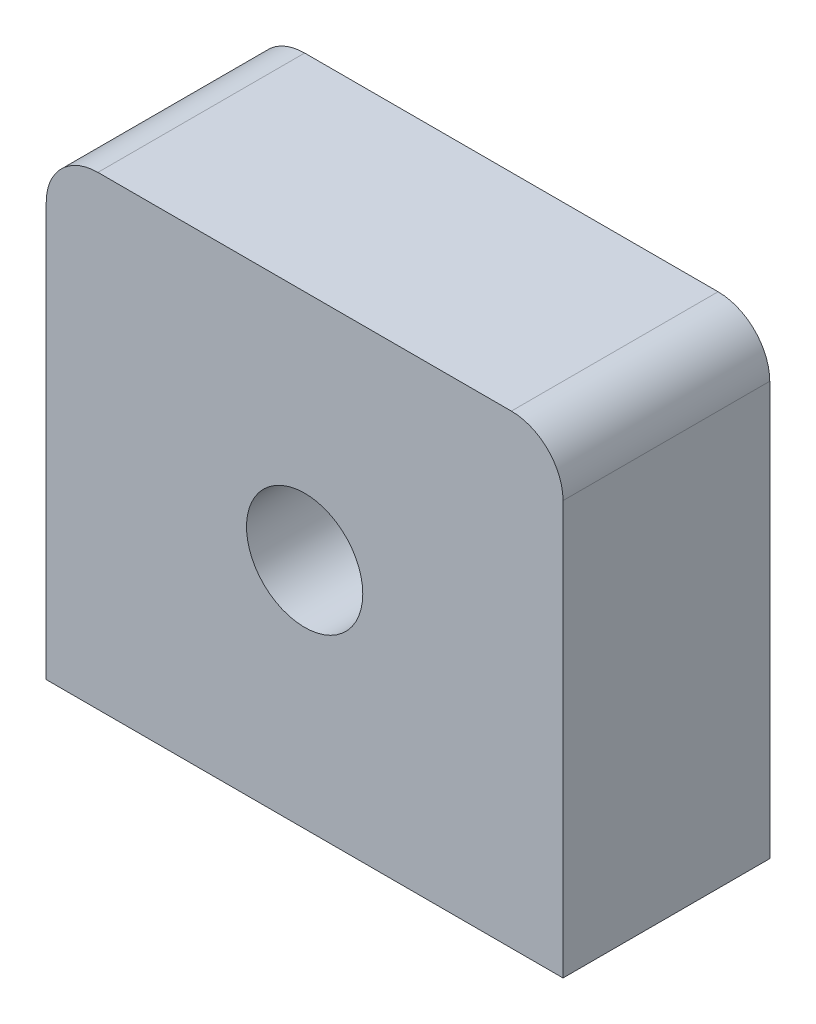
ISO-10303-21;
HEADER;
FILE_DESCRIPTION(('STEP AP214'),'2;1');
FILE_NAME('part.step','',(''),(''),'','','');
FILE_SCHEMA(('AUTOMOTIVE_DESIGN { 1 0 10303 214 1 1 1 1 }'));
ENDSEC;
DATA;
#1=APPLICATION_CONTEXT('core data for automotive mechanical design processes');
#2=APPLICATION_PROTOCOL_DEFINITION('international standard','automotive_design',2000,#1);
#3=PRODUCT_CONTEXT('',#1,'mechanical');
#4=PRODUCT('Part','Part','',(#3));
#5=PRODUCT_RELATED_PRODUCT_CATEGORY('part','',(#4));
#6=PRODUCT_DEFINITION_FORMATION('','',#4);
#7=PRODUCT_DEFINITION_CONTEXT('part definition',#1,'design');
#8=PRODUCT_DEFINITION('design','',#6,#7);
#9=PRODUCT_DEFINITION_SHAPE('','',#8);
#10=(LENGTH_UNIT() NAMED_UNIT(*) SI_UNIT(.MILLI.,.METRE.));
#11=(NAMED_UNIT(*) PLANE_ANGLE_UNIT() SI_UNIT($,.RADIAN.));
#12=(NAMED_UNIT(*) SI_UNIT($,.STERADIAN.) SOLID_ANGLE_UNIT());
#13=UNCERTAINTY_MEASURE_WITH_UNIT(LENGTH_MEASURE(1.E-05),#10,'distance_accuracy_value','');
#14=(GEOMETRIC_REPRESENTATION_CONTEXT(3) GLOBAL_UNCERTAINTY_ASSIGNED_CONTEXT((#13)) GLOBAL_UNIT_ASSIGNED_CONTEXT((#10,
#11,#12)) REPRESENTATION_CONTEXT('',''));
#15=CARTESIAN_POINT('',(0.,0.,0.));
#16=DIRECTION('',(0.,0.,1.));
#17=DIRECTION('',(1.,0.,0.));
#18=AXIS2_PLACEMENT_3D('',#15,#16,#17);
#19=CARTESIAN_POINT('',(2.,16.,8.));
#20=DIRECTION('',(0.,0.,-1.));
#21=DIRECTION('',(-1.,0.,0.));
#22=AXIS2_PLACEMENT_3D('',#19,#20,#21);
#23=PLANE('',#22);
#24=DIRECTION('',(1.,0.,0.));
#25=VECTOR('',#24,1.);
#26=CARTESIAN_POINT('',(20.,0.,8.));
#27=LINE('',#26,#25);
#28=CARTESIAN_POINT('',(0.,0.,8.));
#29=VERTEX_POINT('',#28);
#30=CARTESIAN_POINT('',(20.,0.,8.));
#31=VERTEX_POINT('',#30);
#32=EDGE_CURVE('E131',#29,#31,#27,.T.);
#33=ORIENTED_EDGE('',*,*,#32,.T.);
#34=DIRECTION('',(0.,1.,0.));
#35=VECTOR('',#34,1.);
#36=CARTESIAN_POINT('',(20.,16.,8.));
#37=LINE('',#36,#35);
#38=CARTESIAN_POINT('',(20.,16.,8.));
#39=VERTEX_POINT('',#38);
#40=EDGE_CURVE('E89',#31,#39,#37,.T.);
#41=ORIENTED_EDGE('',*,*,#40,.T.);
#42=CARTESIAN_POINT('',(18.,16.,8.));
#43=DIRECTION('',(0.,0.,1.));
#44=DIRECTION('',(1.,0.,0.));
#45=AXIS2_PLACEMENT_3D('',#42,#43,#44);
#46=CIRCLE('',#45,2.);
#47=CARTESIAN_POINT('',(18.,18.,8.));
#48=VERTEX_POINT('',#47);
#49=EDGE_CURVE('E102',#39,#48,#46,.T.);
#50=ORIENTED_EDGE('',*,*,#49,.T.);
#51=DIRECTION('',(-1.,0.,0.));
#52=VECTOR('',#51,1.);
#53=CARTESIAN_POINT('',(2.00000000000001,18.,8.));
#54=LINE('',#53,#52);
#55=CARTESIAN_POINT('',(2.00000000000001,18.,8.));
#56=VERTEX_POINT('',#55);
#57=EDGE_CURVE('E96',#48,#56,#54,.T.);
#58=ORIENTED_EDGE('',*,*,#57,.T.);
#59=CARTESIAN_POINT('',(2.,16.,8.));
#60=DIRECTION('',(0.,0.,1.));
#61=DIRECTION('',(-1.,0.,0.));
#62=AXIS2_PLACEMENT_3D('',#59,#60,#61);
#63=CIRCLE('',#62,2.);
#64=CARTESIAN_POINT('',(0.,16.,8.));
#65=VERTEX_POINT('',#64);
#66=EDGE_CURVE('E100',#56,#65,#63,.T.);
#67=ORIENTED_EDGE('',*,*,#66,.T.);
#68=DIRECTION('',(0.,-1.,0.));
#69=VECTOR('',#68,1.);
#70=CARTESIAN_POINT('',(0.,0.,8.));
#71=LINE('',#70,#69);
#72=EDGE_CURVE('E52',#65,#29,#71,.T.);
#73=ORIENTED_EDGE('',*,*,#72,.T.);
#74=EDGE_LOOP('',(#33,#41,#50,#58,#67,#73));
#75=FACE_BOUND('',#74,.T.);
#76=CARTESIAN_POINT('',(10.,9.,8.));
#77=DIRECTION('',(0.,0.,1.));
#78=DIRECTION('',(1.,0.,0.));
#79=AXIS2_PLACEMENT_3D('',#76,#77,#78);
#80=CIRCLE('',#79,2.25);
#81=CARTESIAN_POINT('',(12.25,9.,8.));
#82=VERTEX_POINT('',#81);
#83=EDGE_CURVE('E124',#82,#82,#80,.T.);
#84=ORIENTED_EDGE('',*,*,#83,.F.);
#85=EDGE_LOOP('',(#84));
#86=FACE_BOUND('',#85,.T.);
#87=ADVANCED_FACE('F35',(#75,#86),#23,.F.);
#88=CARTESIAN_POINT('',(2.,16.,0.));
#89=DIRECTION('',(0.,0.,-1.));
#90=DIRECTION('',(-1.,0.,0.));
#91=AXIS2_PLACEMENT_3D('',#88,#89,#90);
#92=PLANE('',#91);
#93=DIRECTION('',(1.,0.,0.));
#94=VECTOR('',#93,1.);
#95=CARTESIAN_POINT('',(20.,0.,0.));
#96=LINE('',#95,#94);
#97=CARTESIAN_POINT('',(0.,0.,0.));
#98=VERTEX_POINT('',#97);
#99=CARTESIAN_POINT('',(20.,0.,0.));
#100=VERTEX_POINT('',#99);
#101=EDGE_CURVE('E120',#98,#100,#96,.T.);
#102=ORIENTED_EDGE('',*,*,#101,.F.);
#103=DIRECTION('',(0.,-1.,0.));
#104=VECTOR('',#103,1.);
#105=CARTESIAN_POINT('',(0.,0.,0.));
#106=LINE('',#105,#104);
#107=CARTESIAN_POINT('',(0.,16.,0.));
#108=VERTEX_POINT('',#107);
#109=EDGE_CURVE('E81',#108,#98,#106,.T.);
#110=ORIENTED_EDGE('',*,*,#109,.F.);
#111=CARTESIAN_POINT('',(2.,16.,0.));
#112=DIRECTION('',(0.,0.,1.));
#113=DIRECTION('',(-1.,0.,0.));
#114=AXIS2_PLACEMENT_3D('',#111,#112,#113);
#115=CIRCLE('',#114,2.);
#116=CARTESIAN_POINT('',(2.00000000000001,18.,0.));
#117=VERTEX_POINT('',#116);
#118=EDGE_CURVE('E75',#117,#108,#115,.T.);
#119=ORIENTED_EDGE('',*,*,#118,.F.);
#120=DIRECTION('',(-1.,0.,0.));
#121=VECTOR('',#120,1.);
#122=CARTESIAN_POINT('',(2.00000000000001,18.,0.));
#123=LINE('',#122,#121);
#124=CARTESIAN_POINT('',(18.,18.,0.));
#125=VERTEX_POINT('',#124);
#126=EDGE_CURVE('E110',#125,#117,#123,.T.);
#127=ORIENTED_EDGE('',*,*,#126,.F.);
#128=CARTESIAN_POINT('',(18.,16.,0.));
#129=DIRECTION('',(0.,0.,1.));
#130=DIRECTION('',(1.,0.,0.));
#131=AXIS2_PLACEMENT_3D('',#128,#129,#130);
#132=CIRCLE('',#131,2.);
#133=CARTESIAN_POINT('',(20.,16.,0.));
#134=VERTEX_POINT('',#133);
#135=EDGE_CURVE('E126',#134,#125,#132,.T.);
#136=ORIENTED_EDGE('',*,*,#135,.F.);
#137=DIRECTION('',(0.,1.,0.));
#138=VECTOR('',#137,1.);
#139=CARTESIAN_POINT('',(20.,16.,0.));
#140=LINE('',#139,#138);
#141=EDGE_CURVE('E123',#100,#134,#140,.T.);
#142=ORIENTED_EDGE('',*,*,#141,.F.);
#143=EDGE_LOOP('',(#102,#110,#119,#127,#136,#142));
#144=FACE_BOUND('',#143,.T.);
#145=CARTESIAN_POINT('',(10.,9.,0.));
#146=DIRECTION('',(0.,0.,1.));
#147=DIRECTION('',(1.,0.,0.));
#148=AXIS2_PLACEMENT_3D('',#145,#146,#147);
#149=CIRCLE('',#148,2.25);
#150=CARTESIAN_POINT('',(12.25,9.,0.));
#151=VERTEX_POINT('',#150);
#152=EDGE_CURVE('E224',#151,#151,#149,.T.);
#153=ORIENTED_EDGE('',*,*,#152,.T.);
#154=EDGE_LOOP('',(#153));
#155=FACE_BOUND('',#154,.T.);
#156=ADVANCED_FACE('F140',(#144,#155),#92,.T.);
#157=CARTESIAN_POINT('',(20.,0.,8.));
#158=DIRECTION('',(0.,1.,0.));
#159=DIRECTION('',(0.,0.,1.));
#160=AXIS2_PLACEMENT_3D('',#157,#158,#159);
#161=PLANE('',#160);
#162=ORIENTED_EDGE('',*,*,#101,.T.);
#163=DIRECTION('',(0.,0.,-1.));
#164=VECTOR('',#163,1.);
#165=CARTESIAN_POINT('',(20.,0.,8.));
#166=LINE('',#165,#164);
#167=EDGE_CURVE('E11',#31,#100,#166,.T.);
#168=ORIENTED_EDGE('',*,*,#167,.F.);
#169=ORIENTED_EDGE('',*,*,#32,.F.);
#170=DIRECTION('',(0.,0.,-1.));
#171=VECTOR('',#170,1.);
#172=CARTESIAN_POINT('',(0.,0.,8.));
#173=LINE('',#172,#171);
#174=EDGE_CURVE('E116',#29,#98,#173,.T.);
#175=ORIENTED_EDGE('',*,*,#174,.T.);
#176=EDGE_LOOP('',(#162,#168,#169,#175));
#177=FACE_BOUND('',#176,.T.);
#178=ADVANCED_FACE('F37',(#177),#161,.F.);
#179=CARTESIAN_POINT('',(20.,16.,8.));
#180=DIRECTION('',(-1.,0.,0.));
#181=DIRECTION('',(0.,0.,1.));
#182=AXIS2_PLACEMENT_3D('',#179,#180,#181);
#183=PLANE('',#182);
#184=ORIENTED_EDGE('',*,*,#141,.T.);
#185=DIRECTION('',(0.,0.,-1.));
#186=VECTOR('',#185,1.);
#187=CARTESIAN_POINT('',(20.,16.,8.));
#188=LINE('',#187,#186);
#189=EDGE_CURVE('E44',#39,#134,#188,.T.);
#190=ORIENTED_EDGE('',*,*,#189,.F.);
#191=ORIENTED_EDGE('',*,*,#40,.F.);
#192=ORIENTED_EDGE('',*,*,#167,.T.);
#193=EDGE_LOOP('',(#184,#190,#191,#192));
#194=FACE_BOUND('',#193,.T.);
#195=ADVANCED_FACE('F165',(#194),#183,.F.);
#196=CARTESIAN_POINT('',(18.,16.,8.));
#197=DIRECTION('',(0.,0.,-1.));
#198=DIRECTION('',(-1.,0.,0.));
#199=AXIS2_PLACEMENT_3D('',#196,#197,#198);
#200=CYLINDRICAL_SURFACE('',#199,2.);
#201=ORIENTED_EDGE('',*,*,#135,.T.);
#202=DIRECTION('',(0.,0.,-1.));
#203=VECTOR('',#202,1.);
#204=CARTESIAN_POINT('',(18.,18.,8.));
#205=LINE('',#204,#203);
#206=EDGE_CURVE('E111',#48,#125,#205,.T.);
#207=ORIENTED_EDGE('',*,*,#206,.F.);
#208=ORIENTED_EDGE('',*,*,#49,.F.);
#209=ORIENTED_EDGE('',*,*,#189,.T.);
#210=EDGE_LOOP('',(#201,#207,#208,#209));
#211=FACE_BOUND('',#210,.T.);
#212=ADVANCED_FACE('F137',(#211),#200,.T.);
#213=CARTESIAN_POINT('',(2.00000000000001,18.,8.));
#214=DIRECTION('',(0.,-1.,0.));
#215=DIRECTION('',(0.,0.,-1.));
#216=AXIS2_PLACEMENT_3D('',#213,#214,#215);
#217=PLANE('',#216);
#218=ORIENTED_EDGE('',*,*,#126,.T.);
#219=DIRECTION('',(0.,0.,-1.));
#220=VECTOR('',#219,1.);
#221=CARTESIAN_POINT('',(2.00000000000001,18.,8.));
#222=LINE('',#221,#220);
#223=EDGE_CURVE('E107',#56,#117,#222,.T.);
#224=ORIENTED_EDGE('',*,*,#223,.F.);
#225=ORIENTED_EDGE('',*,*,#57,.F.);
#226=ORIENTED_EDGE('',*,*,#206,.T.);
#227=EDGE_LOOP('',(#218,#224,#225,#226));
#228=FACE_BOUND('',#227,.T.);
#229=ADVANCED_FACE('F108',(#228),#217,.F.);
#230=CARTESIAN_POINT('',(2.,16.,8.));
#231=DIRECTION('',(0.,0.,-1.));
#232=DIRECTION('',(-1.,0.,0.));
#233=AXIS2_PLACEMENT_3D('',#230,#231,#232);
#234=CYLINDRICAL_SURFACE('',#233,2.);
#235=ORIENTED_EDGE('',*,*,#118,.T.);
#236=DIRECTION('',(0.,0.,-1.));
#237=VECTOR('',#236,1.);
#238=CARTESIAN_POINT('',(0.,16.,8.));
#239=LINE('',#238,#237);
#240=EDGE_CURVE('E112',#65,#108,#239,.T.);
#241=ORIENTED_EDGE('',*,*,#240,.F.);
#242=ORIENTED_EDGE('',*,*,#66,.F.);
#243=ORIENTED_EDGE('',*,*,#223,.T.);
#244=EDGE_LOOP('',(#235,#241,#242,#243));
#245=FACE_BOUND('',#244,.T.);
#246=ADVANCED_FACE('F114',(#245),#234,.T.);
#247=CARTESIAN_POINT('',(0.,0.,8.));
#248=DIRECTION('',(1.,0.,0.));
#249=DIRECTION('',(0.,0.,-1.));
#250=AXIS2_PLACEMENT_3D('',#247,#248,#249);
#251=PLANE('',#250);
#252=ORIENTED_EDGE('',*,*,#109,.T.);
#253=ORIENTED_EDGE('',*,*,#174,.F.);
#254=ORIENTED_EDGE('',*,*,#72,.F.);
#255=ORIENTED_EDGE('',*,*,#240,.T.);
#256=EDGE_LOOP('',(#252,#253,#254,#255));
#257=FACE_BOUND('',#256,.T.);
#258=ADVANCED_FACE('F145',(#257),#251,.F.);
#259=CARTESIAN_POINT('',(10.,9.,8.));
#260=DIRECTION('',(0.,0.,-1.));
#261=DIRECTION('',(-1.,0.,0.));
#262=AXIS2_PLACEMENT_3D('',#259,#260,#261);
#263=CYLINDRICAL_SURFACE('',#262,2.25);
#264=ORIENTED_EDGE('',*,*,#83,.T.);
#265=EDGE_LOOP('',(#264));
#266=FACE_BOUND('',#265,.T.);
#267=ORIENTED_EDGE('',*,*,#152,.F.);
#268=EDGE_LOOP('',(#267));
#269=FACE_BOUND('',#268,.T.);
#270=ADVANCED_FACE('F147',(#266,#269),#263,.F.);
#271=CLOSED_SHELL('',(#87,#156,#178,#195,#212,#229,#246,#258,#270));
#272=MANIFOLD_SOLID_BREP('B2',#271);
#273=ADVANCED_BREP_SHAPE_REPRESENTATION('',(#18,#272),#14);
#274=SHAPE_DEFINITION_REPRESENTATION(#9,#273);
ENDSEC;
END-ISO-10303-21;
